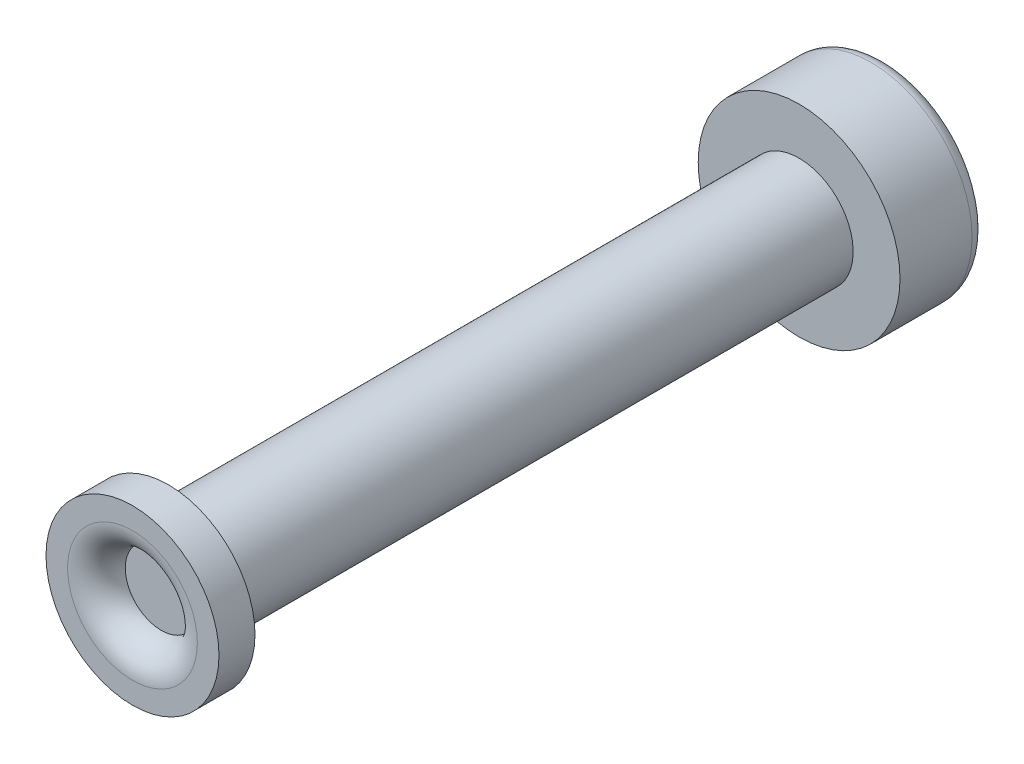
ISO-10303-21;
HEADER;
FILE_DESCRIPTION(('STEP AP214'),'2;1');
FILE_NAME('part.step','',(''),(''),'','','');
FILE_SCHEMA(('AUTOMOTIVE_DESIGN { 1 0 10303 214 1 1 1 1 }'));
ENDSEC;
DATA;
#1=APPLICATION_CONTEXT('core data for automotive mechanical design processes');
#2=APPLICATION_PROTOCOL_DEFINITION('international standard','automotive_design',2000,#1);
#3=PRODUCT_CONTEXT('',#1,'mechanical');
#4=PRODUCT('Part','Part','',(#3));
#5=PRODUCT_RELATED_PRODUCT_CATEGORY('part','',(#4));
#6=PRODUCT_DEFINITION_FORMATION('','',#4);
#7=PRODUCT_DEFINITION_CONTEXT('part definition',#1,'design');
#8=PRODUCT_DEFINITION('design','',#6,#7);
#9=PRODUCT_DEFINITION_SHAPE('','',#8);
#10=(LENGTH_UNIT() NAMED_UNIT(*) SI_UNIT(.MILLI.,.METRE.));
#11=(NAMED_UNIT(*) PLANE_ANGLE_UNIT() SI_UNIT($,.RADIAN.));
#12=(NAMED_UNIT(*) SI_UNIT($,.STERADIAN.) SOLID_ANGLE_UNIT());
#13=UNCERTAINTY_MEASURE_WITH_UNIT(LENGTH_MEASURE(1.E-05),#10,'distance_accuracy_value','');
#14=(GEOMETRIC_REPRESENTATION_CONTEXT(3) GLOBAL_UNCERTAINTY_ASSIGNED_CONTEXT((#13)) GLOBAL_UNIT_ASSIGNED_CONTEXT((#10,
#11,#12)) REPRESENTATION_CONTEXT('',''));
#15=CARTESIAN_POINT('',(0.,0.,0.));
#16=DIRECTION('',(0.,0.,1.));
#17=DIRECTION('',(1.,0.,0.));
#18=AXIS2_PLACEMENT_3D('',#15,#16,#17);
#19=CARTESIAN_POINT('',(0.,-7.99,-9.75));
#20=DIRECTION('',(0.,0.,-1.));
#21=DIRECTION('',(0.,-1.,0.));
#22=AXIS2_PLACEMENT_3D('',#19,#20,#21);
#23=PLANE('',#22);
#24=CARTESIAN_POINT('',(0.,-7.99,-9.75));
#25=DIRECTION('',(0.,0.,-1.));
#26=DIRECTION('',(1.,0.,0.));
#27=AXIS2_PLACEMENT_3D('',#24,#25,#26);
#28=CIRCLE('',#27,0.75);
#29=CARTESIAN_POINT('',(-0.75,-7.99,-9.75));
#30=VERTEX_POINT('',#29);
#31=EDGE_CURVE('E58',#30,#30,#28,.T.);
#32=ORIENTED_EDGE('',*,*,#31,.T.);
#33=EDGE_LOOP('',(#32));
#34=FACE_BOUND('',#33,.T.);
#35=CARTESIAN_POINT('',(0.,-7.99,-9.75));
#36=DIRECTION('',(0.,0.,-1.));
#37=DIRECTION('',(1.,0.,0.));
#38=AXIS2_PLACEMENT_3D('',#35,#36,#37);
#39=CIRCLE('',#38,1.4);
#40=CARTESIAN_POINT('',(-1.4,-7.99,-9.75));
#41=VERTEX_POINT('',#40);
#42=EDGE_CURVE('E11',#41,#41,#39,.T.);
#43=ORIENTED_EDGE('',*,*,#42,.F.);
#44=EDGE_LOOP('',(#43));
#45=FACE_BOUND('',#44,.T.);
#46=ADVANCED_FACE('F16',(#34,#45),#23,.F.);
#47=CARTESIAN_POINT('',(0.,-7.99,-10.95));
#48=DIRECTION('',(0.,0.,-1.));
#49=DIRECTION('',(0.,-1.,0.));
#50=AXIS2_PLACEMENT_3D('',#47,#48,#49);
#51=PLANE('',#50);
#52=CARTESIAN_POINT('',(0.,-7.99,-10.95));
#53=DIRECTION('',(0.,0.,1.));
#54=DIRECTION('',(1.,0.,0.));
#55=AXIS2_PLACEMENT_3D('',#52,#53,#54);
#56=CIRCLE('',#55,1.2);
#57=CARTESIAN_POINT('',(1.2,-7.99,-10.95));
#58=VERTEX_POINT('',#57);
#59=EDGE_CURVE('E123',#58,#58,#56,.T.);
#60=ORIENTED_EDGE('',*,*,#59,.F.);
#61=EDGE_LOOP('',(#60));
#62=FACE_BOUND('',#61,.T.);
#63=ADVANCED_FACE('F137',(#62),#51,.T.);
#64=CARTESIAN_POINT('',(0.,-7.99,-9.75));
#65=DIRECTION('',(0.,0.,-1.));
#66=DIRECTION('',(1.,0.,0.));
#67=AXIS2_PLACEMENT_3D('',#64,#65,#66);
#68=CYLINDRICAL_SURFACE('',#67,1.4);
#69=CARTESIAN_POINT('',(0.,-7.99,-10.75));
#70=DIRECTION('',(0.,0.,-1.));
#71=DIRECTION('',(1.,0.,0.));
#72=AXIS2_PLACEMENT_3D('',#69,#70,#71);
#73=CIRCLE('',#72,1.4);
#74=CARTESIAN_POINT('',(-1.4,-7.99,-10.75));
#75=VERTEX_POINT('',#74);
#76=CARTESIAN_POINT('',(1.4,-7.99,-10.75));
#77=VERTEX_POINT('',#76);
#78=EDGE_CURVE('E114',#75,#77,#73,.T.);
#79=ORIENTED_EDGE('',*,*,#78,.F.);
#80=DIRECTION('',(0.,0.,1.));
#81=VECTOR('',#80,1.);
#82=CARTESIAN_POINT('',(-1.4,-7.99,-9.75));
#83=LINE('',#82,#81);
#84=EDGE_CURVE('E20',#75,#41,#83,.T.);
#85=ORIENTED_EDGE('',*,*,#84,.T.);
#86=ORIENTED_EDGE('',*,*,#42,.T.);
#87=ORIENTED_EDGE('',*,*,#84,.F.);
#88=CARTESIAN_POINT('',(0.,-7.99,-10.75));
#89=DIRECTION('',(0.,0.,-1.));
#90=DIRECTION('',(1.,0.,0.));
#91=AXIS2_PLACEMENT_3D('',#88,#89,#90);
#92=CIRCLE('',#91,1.4);
#93=EDGE_CURVE('E111',#77,#75,#92,.T.);
#94=ORIENTED_EDGE('',*,*,#93,.F.);
#95=EDGE_LOOP('',(#79,#85,#86,#87,#94));
#96=FACE_BOUND('',#95,.T.);
#97=ADVANCED_FACE('F139',(#96),#68,.T.);
#98=CARTESIAN_POINT('',(0.,-7.99,-10.75));
#99=DIRECTION('',(0.,0.,-1.));
#100=DIRECTION('',(-1.,0.,0.));
#101=AXIS2_PLACEMENT_3D('',#98,#99,#100);
#102=TOROIDAL_SURFACE('',#101,1.2,0.2);
#103=ORIENTED_EDGE('',*,*,#59,.T.);
#104=CARTESIAN_POINT('',(1.2,-7.99,-10.75));
#105=DIRECTION('',(0.,-1.,0.));
#106=DIRECTION('',(1.,0.,0.));
#107=AXIS2_PLACEMENT_3D('',#104,#105,#106);
#108=CIRCLE('',#107,0.2);
#109=EDGE_CURVE('E52',#58,#77,#108,.T.);
#110=ORIENTED_EDGE('',*,*,#109,.T.);
#111=ORIENTED_EDGE('',*,*,#93,.T.);
#112=ORIENTED_EDGE('',*,*,#78,.T.);
#113=ORIENTED_EDGE('',*,*,#109,.F.);
#114=EDGE_LOOP('',(#103,#110,#111,#112,#113));
#115=FACE_BOUND('',#114,.T.);
#116=ADVANCED_FACE('F133',(#115),#102,.T.);
#117=CARTESIAN_POINT('',(0.,-7.99,-9.75));
#118=DIRECTION('',(0.,0.,1.));
#119=DIRECTION('',(1.,0.,0.));
#120=AXIS2_PLACEMENT_3D('',#117,#118,#119);
#121=CYLINDRICAL_SURFACE('',#120,0.75);
#122=CARTESIAN_POINT('',(0.,-7.99,-1.));
#123=DIRECTION('',(0.,0.,-1.));
#124=DIRECTION('',(1.,0.,0.));
#125=AXIS2_PLACEMENT_3D('',#122,#123,#124);
#126=CIRCLE('',#125,0.75);
#127=CARTESIAN_POINT('',(-0.75,-7.99,-1.));
#128=VERTEX_POINT('',#127);
#129=EDGE_CURVE('E110',#128,#128,#126,.T.);
#130=ORIENTED_EDGE('',*,*,#129,.T.);
#131=DIRECTION('',(0.,0.,-1.));
#132=VECTOR('',#131,1.);
#133=CARTESIAN_POINT('',(-0.75,-7.99,-9.75));
#134=LINE('',#133,#132);
#135=EDGE_CURVE('E68',#128,#30,#134,.T.);
#136=ORIENTED_EDGE('',*,*,#135,.T.);
#137=ORIENTED_EDGE('',*,*,#31,.F.);
#138=ORIENTED_EDGE('',*,*,#135,.F.);
#139=EDGE_LOOP('',(#130,#136,#137,#138));
#140=FACE_BOUND('',#139,.T.);
#141=ADVANCED_FACE('F151',(#140),#121,.T.);
#142=CARTESIAN_POINT('',(0.,-7.99,-1.));
#143=DIRECTION('',(0.,0.,1.));
#144=DIRECTION('',(-1.,0.,0.));
#145=AXIS2_PLACEMENT_3D('',#142,#143,#144);
#146=CYLINDRICAL_SURFACE('',#145,1.2);
#147=CARTESIAN_POINT('',(0.,-7.99,-0.5));
#148=DIRECTION('',(0.,0.,1.));
#149=DIRECTION('',(-1.,0.,0.));
#150=AXIS2_PLACEMENT_3D('',#147,#148,#149);
#151=CIRCLE('',#150,1.2);
#152=CARTESIAN_POINT('',(1.2,-7.99,-0.5));
#153=VERTEX_POINT('',#152);
#154=EDGE_CURVE('E105',#153,#153,#151,.T.);
#155=ORIENTED_EDGE('',*,*,#154,.F.);
#156=DIRECTION('',(0.,0.,-1.));
#157=VECTOR('',#156,1.);
#158=CARTESIAN_POINT('',(1.2,-7.99,-1.));
#159=LINE('',#158,#157);
#160=CARTESIAN_POINT('',(1.2,-7.99,-1.));
#161=VERTEX_POINT('',#160);
#162=EDGE_CURVE('E83',#153,#161,#159,.T.);
#163=ORIENTED_EDGE('',*,*,#162,.T.);
#164=CARTESIAN_POINT('',(0.,-7.99,-1.));
#165=DIRECTION('',(0.,0.,1.));
#166=DIRECTION('',(-1.,0.,0.));
#167=AXIS2_PLACEMENT_3D('',#164,#165,#166);
#168=CIRCLE('',#167,1.2);
#169=EDGE_CURVE('E120',#161,#161,#168,.T.);
#170=ORIENTED_EDGE('',*,*,#169,.T.);
#171=ORIENTED_EDGE('',*,*,#162,.F.);
#172=EDGE_LOOP('',(#155,#163,#170,#171));
#173=FACE_BOUND('',#172,.T.);
#174=ADVANCED_FACE('F18',(#173),#146,.T.);
#175=CARTESIAN_POINT('',(0.,-7.99,-1.));
#176=DIRECTION('',(0.,0.,1.));
#177=DIRECTION('',(1.,0.,0.));
#178=AXIS2_PLACEMENT_3D('',#175,#176,#177);
#179=PLANE('',#178);
#180=ORIENTED_EDGE('',*,*,#129,.F.);
#181=EDGE_LOOP('',(#180));
#182=FACE_BOUND('',#181,.T.);
#183=ORIENTED_EDGE('',*,*,#169,.F.);
#184=EDGE_LOOP('',(#183));
#185=FACE_BOUND('',#184,.T.);
#186=ADVANCED_FACE('F163',(#182,#185),#179,.F.);
#187=CARTESIAN_POINT('',(0.,-7.99,-0.9));
#188=DIRECTION('',(0.,0.,1.));
#189=DIRECTION('',(1.,0.,0.));
#190=AXIS2_PLACEMENT_3D('',#187,#188,#189);
#191=PLANE('',#190);
#192=CARTESIAN_POINT('',(0.,-7.99,-0.9));
#193=DIRECTION('',(0.,0.,-1.));
#194=DIRECTION('',(-1.,0.,0.));
#195=AXIS2_PLACEMENT_3D('',#192,#193,#194);
#196=CIRCLE('',#195,0.5);
#197=CARTESIAN_POINT('',(0.5,-7.99,-0.9));
#198=VERTEX_POINT('',#197);
#199=EDGE_CURVE('E92',#198,#198,#196,.T.);
#200=ORIENTED_EDGE('',*,*,#199,.F.);
#201=EDGE_LOOP('',(#200));
#202=FACE_BOUND('',#201,.T.);
#203=ADVANCED_FACE('F158',(#202),#191,.T.);
#204=CARTESIAN_POINT('',(0.,-7.99,-0.5));
#205=DIRECTION('',(0.,0.,1.));
#206=DIRECTION('',(1.,0.,0.));
#207=AXIS2_PLACEMENT_3D('',#204,#205,#206);
#208=PLANE('',#207);
#209=CARTESIAN_POINT('',(0.,-7.99,-0.5));
#210=DIRECTION('',(0.,0.,1.));
#211=DIRECTION('',(-1.,0.,0.));
#212=AXIS2_PLACEMENT_3D('',#209,#210,#211);
#213=CIRCLE('',#212,0.9);
#214=CARTESIAN_POINT('',(0.9,-7.99,-0.5));
#215=VERTEX_POINT('',#214);
#216=EDGE_CURVE('E98',#215,#215,#213,.T.);
#217=ORIENTED_EDGE('',*,*,#216,.F.);
#218=EDGE_LOOP('',(#217));
#219=FACE_BOUND('',#218,.T.);
#220=ORIENTED_EDGE('',*,*,#154,.T.);
#221=EDGE_LOOP('',(#220));
#222=FACE_BOUND('',#221,.T.);
#223=ADVANCED_FACE('F154',(#219,#222),#208,.T.);
#224=CARTESIAN_POINT('',(0.,-7.99,-0.9));
#225=DIRECTION('',(0.,0.,-1.));
#226=DIRECTION('',(-1.,0.,0.));
#227=AXIS2_PLACEMENT_3D('',#224,#225,#226);
#228=TOROIDAL_SURFACE('',#227,0.9,0.4);
#229=ORIENTED_EDGE('',*,*,#216,.T.);
#230=CARTESIAN_POINT('',(0.9,-7.99,-0.9));
#231=DIRECTION('',(0.,-1.,0.));
#232=DIRECTION('',(1.,0.,0.));
#233=AXIS2_PLACEMENT_3D('',#230,#231,#232);
#234=CIRCLE('',#233,0.4);
#235=EDGE_CURVE('E95',#215,#198,#234,.T.);
#236=ORIENTED_EDGE('',*,*,#235,.T.);
#237=ORIENTED_EDGE('',*,*,#199,.T.);
#238=ORIENTED_EDGE('',*,*,#235,.F.);
#239=EDGE_LOOP('',(#229,#236,#237,#238));
#240=FACE_BOUND('',#239,.T.);
#241=ADVANCED_FACE('F96',(#240),#228,.T.);
#242=CLOSED_SHELL('',(#46,#63,#97,#116,#141,#174,#186,#203,#223,#241));
#243=MANIFOLD_SOLID_BREP('B1',#242);
#244=ADVANCED_BREP_SHAPE_REPRESENTATION('',(#18,#243),#14);
#245=SHAPE_DEFINITION_REPRESENTATION(#9,#244);
ENDSEC;
END-ISO-10303-21;
